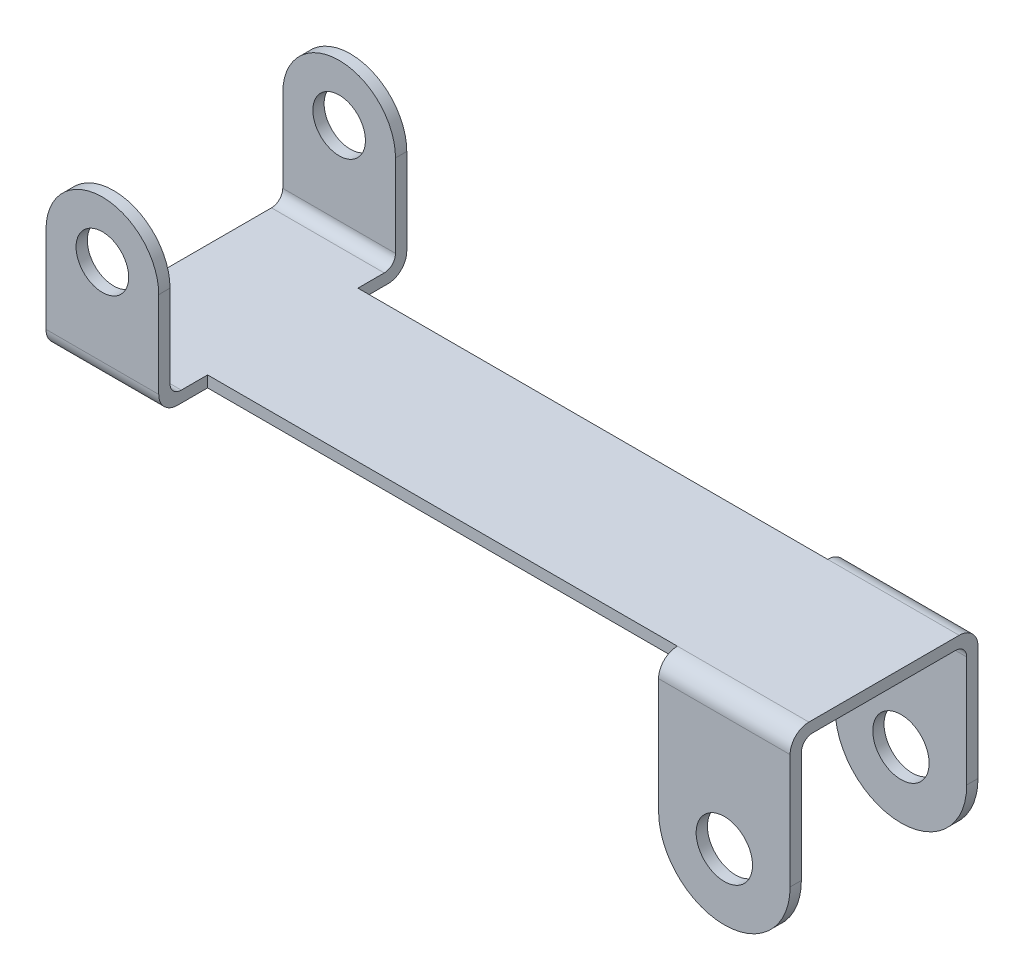
ISO-10303-21;
HEADER;
FILE_DESCRIPTION(('STEP AP214'),'2;1');
FILE_NAME('part.step','',(''),(''),'','','');
FILE_SCHEMA(('AUTOMOTIVE_DESIGN { 1 0 10303 214 1 1 1 1 }'));
ENDSEC;
DATA;
#1=APPLICATION_CONTEXT('core data for automotive mechanical design processes');
#2=APPLICATION_PROTOCOL_DEFINITION('international standard','automotive_design',2000,#1);
#3=PRODUCT_CONTEXT('',#1,'mechanical');
#4=PRODUCT('Part','Part','',(#3));
#5=PRODUCT_RELATED_PRODUCT_CATEGORY('part','',(#4));
#6=PRODUCT_DEFINITION_FORMATION('','',#4);
#7=PRODUCT_DEFINITION_CONTEXT('part definition',#1,'design');
#8=PRODUCT_DEFINITION('design','',#6,#7);
#9=PRODUCT_DEFINITION_SHAPE('','',#8);
#10=(LENGTH_UNIT() NAMED_UNIT(*) SI_UNIT(.MILLI.,.METRE.));
#11=(NAMED_UNIT(*) PLANE_ANGLE_UNIT() SI_UNIT($,.RADIAN.));
#12=(NAMED_UNIT(*) SI_UNIT($,.STERADIAN.) SOLID_ANGLE_UNIT());
#13=UNCERTAINTY_MEASURE_WITH_UNIT(LENGTH_MEASURE(1.E-05),#10,'distance_accuracy_value','');
#14=(GEOMETRIC_REPRESENTATION_CONTEXT(3) GLOBAL_UNCERTAINTY_ASSIGNED_CONTEXT((#13)) GLOBAL_UNIT_ASSIGNED_CONTEXT((#10,
#11,#12)) REPRESENTATION_CONTEXT('',''));
#15=CARTESIAN_POINT('',(0.,0.,0.));
#16=DIRECTION('',(0.,0.,1.));
#17=DIRECTION('',(1.,0.,0.));
#18=AXIS2_PLACEMENT_3D('',#15,#16,#17);
#19=CARTESIAN_POINT('',(17.25,-3.25,-0.5));
#20=DIRECTION('',(0.,0.,-1.));
#21=DIRECTION('',(-1.,0.,0.));
#22=AXIS2_PLACEMENT_3D('',#19,#20,#21);
#23=CYLINDRICAL_SURFACE('',#22,1.75);
#24=DIRECTION('',(0.,0.,1.));
#25=VECTOR('',#24,1.);
#26=CARTESIAN_POINT('',(15.5,-3.25,-0.5));
#27=LINE('',#26,#25);
#28=CARTESIAN_POINT('',(15.5,-3.25,-0.5));
#29=VERTEX_POINT('',#28);
#30=CARTESIAN_POINT('',(15.5,-3.25,-0.2));
#31=VERTEX_POINT('',#30);
#32=EDGE_CURVE('E300',#29,#31,#27,.T.);
#33=ORIENTED_EDGE('',*,*,#32,.F.);
#34=CARTESIAN_POINT('',(17.25,-3.25,-0.5));
#35=DIRECTION('',(0.,0.,-1.));
#36=DIRECTION('',(-1.,0.,0.));
#37=AXIS2_PLACEMENT_3D('',#34,#35,#36);
#38=CIRCLE('',#37,1.75);
#39=CARTESIAN_POINT('',(19.,-3.25,-0.5));
#40=VERTEX_POINT('',#39);
#41=EDGE_CURVE('E306',#40,#29,#38,.T.);
#42=ORIENTED_EDGE('',*,*,#41,.F.);
#43=DIRECTION('',(0.,0.,-1.));
#44=VECTOR('',#43,1.);
#45=CARTESIAN_POINT('',(19.,-3.25,0.));
#46=LINE('',#45,#44);
#47=CARTESIAN_POINT('',(19.,-3.25,-0.2));
#48=VERTEX_POINT('',#47);
#49=EDGE_CURVE('E303',#48,#40,#46,.T.);
#50=ORIENTED_EDGE('',*,*,#49,.F.);
#51=CARTESIAN_POINT('',(17.25,-3.25,-0.2));
#52=DIRECTION('',(0.,0.,-1.));
#53=DIRECTION('',(-1.,0.,0.));
#54=AXIS2_PLACEMENT_3D('',#51,#52,#53);
#55=CIRCLE('',#54,1.75);
#56=EDGE_CURVE('E308',#31,#48,#55,.F.);
#57=ORIENTED_EDGE('',*,*,#56,.F.);
#58=EDGE_LOOP('',(#33,#42,#50,#57));
#59=FACE_BOUND('',#58,.T.);
#60=ADVANCED_FACE('F34',(#59),#23,.T.);
#61=CARTESIAN_POINT('',(17.25,-3.25,4.2));
#62=DIRECTION('',(0.,0.,-1.));
#63=DIRECTION('',(-1.,0.,0.));
#64=AXIS2_PLACEMENT_3D('',#61,#62,#63);
#65=CYLINDRICAL_SURFACE('',#64,1.75);
#66=DIRECTION('',(0.,0.,-1.));
#67=VECTOR('',#66,1.);
#68=CARTESIAN_POINT('',(15.5,-3.25,4.));
#69=LINE('',#68,#67);
#70=CARTESIAN_POINT('',(15.5,-3.25,4.2));
#71=VERTEX_POINT('',#70);
#72=CARTESIAN_POINT('',(15.5,-3.25,4.5));
#73=VERTEX_POINT('',#72);
#74=EDGE_CURVE('E285',#71,#73,#69,.F.);
#75=ORIENTED_EDGE('',*,*,#74,.F.);
#76=CARTESIAN_POINT('',(17.25,-3.25,4.2));
#77=DIRECTION('',(0.,0.,1.));
#78=DIRECTION('',(1.,0.,0.));
#79=AXIS2_PLACEMENT_3D('',#76,#77,#78);
#80=CIRCLE('',#79,1.75);
#81=CARTESIAN_POINT('',(19.,-3.25,4.2));
#82=VERTEX_POINT('',#81);
#83=EDGE_CURVE('E296',#82,#71,#80,.F.);
#84=ORIENTED_EDGE('',*,*,#83,.F.);
#85=DIRECTION('',(0.,0.,1.));
#86=VECTOR('',#85,1.);
#87=CARTESIAN_POINT('',(19.,-3.25,4.2));
#88=LINE('',#87,#86);
#89=CARTESIAN_POINT('',(19.,-3.25,4.5));
#90=VERTEX_POINT('',#89);
#91=EDGE_CURVE('E293',#90,#82,#88,.F.);
#92=ORIENTED_EDGE('',*,*,#91,.F.);
#93=CARTESIAN_POINT('',(17.25,-3.25,4.5));
#94=DIRECTION('',(0.,0.,1.));
#95=DIRECTION('',(1.,0.,0.));
#96=AXIS2_PLACEMENT_3D('',#93,#94,#95);
#97=CIRCLE('',#96,1.75);
#98=EDGE_CURVE('E298',#73,#90,#97,.T.);
#99=ORIENTED_EDGE('',*,*,#98,.F.);
#100=EDGE_LOOP('',(#75,#84,#92,#99));
#101=FACE_BOUND('',#100,.T.);
#102=ADVANCED_FACE('F496',(#101),#65,.T.);
#103=CARTESIAN_POINT('',(0.,0.,0.));
#104=DIRECTION('',(0.,1.,0.));
#105=DIRECTION('',(0.,0.,1.));
#106=AXIS2_PLACEMENT_3D('',#103,#104,#105);
#107=PLANE('',#106);
#108=DIRECTION('',(0.,0.,1.));
#109=VECTOR('',#108,1.);
#110=CARTESIAN_POINT('',(3.,0.,4.));
#111=LINE('',#110,#109);
#112=CARTESIAN_POINT('',(3.,0.,4.));
#113=VERTEX_POINT('',#112);
#114=CARTESIAN_POINT('',(3.,0.,4.8));
#115=VERTEX_POINT('',#114);
#116=EDGE_CURVE('E233',#113,#115,#111,.T.);
#117=ORIENTED_EDGE('',*,*,#116,.T.);
#118=DIRECTION('',(-1.,0.,0.));
#119=VECTOR('',#118,1.);
#120=CARTESIAN_POINT('',(0.,0.,4.8));
#121=LINE('',#120,#119);
#122=CARTESIAN_POINT('',(0.,0.,4.8));
#123=VERTEX_POINT('',#122);
#124=EDGE_CURVE('E359',#115,#123,#121,.T.);
#125=ORIENTED_EDGE('',*,*,#124,.T.);
#126=DIRECTION('',(0.,0.,1.));
#127=VECTOR('',#126,1.);
#128=CARTESIAN_POINT('',(0.,0.,0.));
#129=LINE('',#128,#127);
#130=CARTESIAN_POINT('',(0.,0.,-0.8));
#131=VERTEX_POINT('',#130);
#132=EDGE_CURVE('E255',#131,#123,#129,.T.);
#133=ORIENTED_EDGE('',*,*,#132,.F.);
#134=DIRECTION('',(1.,0.,0.));
#135=VECTOR('',#134,1.);
#136=CARTESIAN_POINT('',(3.,0.,-0.8));
#137=LINE('',#136,#135);
#138=CARTESIAN_POINT('',(3.,0.,-0.8));
#139=VERTEX_POINT('',#138);
#140=EDGE_CURVE('E356',#131,#139,#137,.T.);
#141=ORIENTED_EDGE('',*,*,#140,.T.);
#142=DIRECTION('',(0.,0.,1.));
#143=VECTOR('',#142,1.);
#144=CARTESIAN_POINT('',(3.,0.,0.));
#145=LINE('',#144,#143);
#146=CARTESIAN_POINT('',(3.,0.,0.));
#147=VERTEX_POINT('',#146);
#148=EDGE_CURVE('E444',#139,#147,#145,.T.);
#149=ORIENTED_EDGE('',*,*,#148,.T.);
#150=DIRECTION('',(-1.,0.,0.));
#151=VECTOR('',#150,1.);
#152=CARTESIAN_POINT('',(0.,0.,0.));
#153=LINE('',#152,#151);
#154=CARTESIAN_POINT('',(15.5,0.,0.));
#155=VERTEX_POINT('',#154);
#156=EDGE_CURVE('E248',#155,#147,#153,.T.);
#157=ORIENTED_EDGE('',*,*,#156,.F.);
#158=DIRECTION('',(0.,0.,1.));
#159=VECTOR('',#158,1.);
#160=CARTESIAN_POINT('',(15.5,0.,0.));
#161=LINE('',#160,#159);
#162=CARTESIAN_POINT('',(15.5,0.,0.0999999999999998));
#163=VERTEX_POINT('',#162);
#164=EDGE_CURVE('E320',#155,#163,#161,.T.);
#165=ORIENTED_EDGE('',*,*,#164,.T.);
#166=DIRECTION('',(-1.,0.,0.));
#167=VECTOR('',#166,1.);
#168=CARTESIAN_POINT('',(19.,0.,0.0999999999999998));
#169=LINE('',#168,#167);
#170=CARTESIAN_POINT('',(19.,0.,0.0999999999999998));
#171=VERTEX_POINT('',#170);
#172=EDGE_CURVE('E318',#163,#171,#169,.F.);
#173=ORIENTED_EDGE('',*,*,#172,.T.);
#174=DIRECTION('',(0.,0.,-1.));
#175=VECTOR('',#174,1.);
#176=CARTESIAN_POINT('',(19.,0.,0.));
#177=LINE('',#176,#175);
#178=CARTESIAN_POINT('',(19.,0.,3.9));
#179=VERTEX_POINT('',#178);
#180=EDGE_CURVE('E261',#179,#171,#177,.T.);
#181=ORIENTED_EDGE('',*,*,#180,.F.);
#182=DIRECTION('',(1.,0.,0.));
#183=VECTOR('',#182,1.);
#184=CARTESIAN_POINT('',(15.5,0.,3.9));
#185=LINE('',#184,#183);
#186=CARTESIAN_POINT('',(15.5,0.,3.9));
#187=VERTEX_POINT('',#186);
#188=EDGE_CURVE('E325',#179,#187,#185,.F.);
#189=ORIENTED_EDGE('',*,*,#188,.T.);
#190=DIRECTION('',(0.,0.,1.));
#191=VECTOR('',#190,1.);
#192=CARTESIAN_POINT('',(15.5,0.,0.));
#193=LINE('',#192,#191);
#194=CARTESIAN_POINT('',(15.5,0.,4.));
#195=VERTEX_POINT('',#194);
#196=EDGE_CURVE('E323',#187,#195,#193,.T.);
#197=ORIENTED_EDGE('',*,*,#196,.T.);
#198=DIRECTION('',(1.,0.,0.));
#199=VECTOR('',#198,1.);
#200=CARTESIAN_POINT('',(0.,0.,4.));
#201=LINE('',#200,#199);
#202=EDGE_CURVE('E258',#113,#195,#201,.T.);
#203=ORIENTED_EDGE('',*,*,#202,.F.);
#204=EDGE_LOOP('',(#117,#125,#133,#141,#149,#157,#165,#173,#181,#189,#197,#203));
#205=FACE_BOUND('',#204,.T.);
#206=ADVANCED_FACE('F467',(#205),#107,.F.);
#207=CARTESIAN_POINT('',(1.5,2.8,5.));
#208=DIRECTION('',(0.,0.,-1.));
#209=DIRECTION('',(-1.,0.,0.));
#210=AXIS2_PLACEMENT_3D('',#207,#208,#209);
#211=CYLINDRICAL_SURFACE('',#210,1.5);
#212=DIRECTION('',(0.,0.,-1.));
#213=VECTOR('',#212,1.);
#214=CARTESIAN_POINT('',(3.,2.8,4.));
#215=LINE('',#214,#213);
#216=CARTESIAN_POINT('',(3.,2.8,5.));
#217=VERTEX_POINT('',#216);
#218=CARTESIAN_POINT('',(3.,2.8,5.3));
#219=VERTEX_POINT('',#218);
#220=EDGE_CURVE('E275',#217,#219,#215,.F.);
#221=ORIENTED_EDGE('',*,*,#220,.F.);
#222=CARTESIAN_POINT('',(1.5,2.8,5.));
#223=DIRECTION('',(0.,0.,1.));
#224=DIRECTION('',(1.,0.,0.));
#225=AXIS2_PLACEMENT_3D('',#222,#223,#224);
#226=CIRCLE('',#225,1.5);
#227=CARTESIAN_POINT('',(0.,2.8,5.));
#228=VERTEX_POINT('',#227);
#229=EDGE_CURVE('E281',#228,#217,#226,.F.);
#230=ORIENTED_EDGE('',*,*,#229,.F.);
#231=DIRECTION('',(0.,0.,1.));
#232=VECTOR('',#231,1.);
#233=CARTESIAN_POINT('',(0.,2.8,5.));
#234=LINE('',#233,#232);
#235=CARTESIAN_POINT('',(0.,2.8,5.3));
#236=VERTEX_POINT('',#235);
#237=EDGE_CURVE('E278',#236,#228,#234,.F.);
#238=ORIENTED_EDGE('',*,*,#237,.F.);
#239=CARTESIAN_POINT('',(1.5,2.8,5.3));
#240=DIRECTION('',(0.,0.,1.));
#241=DIRECTION('',(1.,0.,0.));
#242=AXIS2_PLACEMENT_3D('',#239,#240,#241);
#243=CIRCLE('',#242,1.5);
#244=EDGE_CURVE('E283',#219,#236,#243,.T.);
#245=ORIENTED_EDGE('',*,*,#244,.F.);
#246=EDGE_LOOP('',(#221,#230,#238,#245));
#247=FACE_BOUND('',#246,.T.);
#248=ADVANCED_FACE('F687',(#247),#211,.T.);
#249=CARTESIAN_POINT('',(1.5,2.8,-1.3));
#250=DIRECTION('',(0.,0.,-1.));
#251=DIRECTION('',(-1.,0.,0.));
#252=AXIS2_PLACEMENT_3D('',#249,#250,#251);
#253=CYLINDRICAL_SURFACE('',#252,1.5);
#254=DIRECTION('',(0.,0.,-1.));
#255=VECTOR('',#254,1.);
#256=CARTESIAN_POINT('',(3.,2.8,0.));
#257=LINE('',#256,#255);
#258=CARTESIAN_POINT('',(3.,2.8,-1.3));
#259=VERTEX_POINT('',#258);
#260=CARTESIAN_POINT('',(3.,2.8,-1.));
#261=VERTEX_POINT('',#260);
#262=EDGE_CURVE('E254',#259,#261,#257,.F.);
#263=ORIENTED_EDGE('',*,*,#262,.F.);
#264=CARTESIAN_POINT('',(1.5,2.8,-1.3));
#265=DIRECTION('',(0.,0.,-1.));
#266=DIRECTION('',(-1.,0.,0.));
#267=AXIS2_PLACEMENT_3D('',#264,#265,#266);
#268=CIRCLE('',#267,1.5);
#269=CARTESIAN_POINT('',(0.,2.8,-1.3));
#270=VERTEX_POINT('',#269);
#271=EDGE_CURVE('E271',#270,#259,#268,.T.);
#272=ORIENTED_EDGE('',*,*,#271,.F.);
#273=DIRECTION('',(0.,0.,1.));
#274=VECTOR('',#273,1.);
#275=CARTESIAN_POINT('',(0.,2.8,-1.3));
#276=LINE('',#275,#274);
#277=CARTESIAN_POINT('',(0.,2.8,-1.));
#278=VERTEX_POINT('',#277);
#279=EDGE_CURVE('E268',#278,#270,#276,.F.);
#280=ORIENTED_EDGE('',*,*,#279,.F.);
#281=CARTESIAN_POINT('',(1.5,2.8,-1.));
#282=DIRECTION('',(0.,0.,-1.));
#283=DIRECTION('',(-1.,0.,0.));
#284=AXIS2_PLACEMENT_3D('',#281,#282,#283);
#285=CIRCLE('',#284,1.5);
#286=EDGE_CURVE('E273',#261,#278,#285,.F.);
#287=ORIENTED_EDGE('',*,*,#286,.F.);
#288=EDGE_LOOP('',(#263,#272,#280,#287));
#289=FACE_BOUND('',#288,.T.);
#290=ADVANCED_FACE('F482',(#289),#253,.T.);
#291=CARTESIAN_POINT('',(0.,0.3,0.));
#292=DIRECTION('',(0.,1.,0.));
#293=DIRECTION('',(0.,0.,1.));
#294=AXIS2_PLACEMENT_3D('',#291,#292,#293);
#295=PLANE('',#294);
#296=DIRECTION('',(1.,0.,0.));
#297=VECTOR('',#296,1.);
#298=CARTESIAN_POINT('',(0.,0.3,4.));
#299=LINE('',#298,#297);
#300=CARTESIAN_POINT('',(3.,0.3,4.));
#301=VERTEX_POINT('',#300);
#302=CARTESIAN_POINT('',(15.5,0.3,4.));
#303=VERTEX_POINT('',#302);
#304=EDGE_CURVE('E219',#301,#303,#299,.T.);
#305=ORIENTED_EDGE('',*,*,#304,.T.);
#306=DIRECTION('',(1.,0.,0.));
#307=VECTOR('',#306,1.);
#308=CARTESIAN_POINT('',(0.,0.3,4.00000000000001));
#309=LINE('',#308,#307);
#310=CARTESIAN_POINT('',(19.,0.3,4.));
#311=VERTEX_POINT('',#310);
#312=EDGE_CURVE('E377',#303,#311,#309,.T.);
#313=ORIENTED_EDGE('',*,*,#312,.T.);
#314=DIRECTION('',(0.,0.,-1.));
#315=VECTOR('',#314,1.);
#316=CARTESIAN_POINT('',(19.,0.3,0.));
#317=LINE('',#316,#315);
#318=CARTESIAN_POINT('',(19.,0.3,0.));
#319=VERTEX_POINT('',#318);
#320=EDGE_CURVE('E242',#311,#319,#317,.T.);
#321=ORIENTED_EDGE('',*,*,#320,.T.);
#322=DIRECTION('',(-1.,0.,0.));
#323=VECTOR('',#322,1.);
#324=CARTESIAN_POINT('',(0.,0.3,0.));
#325=LINE('',#324,#323);
#326=CARTESIAN_POINT('',(15.5,0.3,0.));
#327=VERTEX_POINT('',#326);
#328=EDGE_CURVE('E374',#319,#327,#325,.T.);
#329=ORIENTED_EDGE('',*,*,#328,.T.);
#330=DIRECTION('',(-1.,0.,0.));
#331=VECTOR('',#330,1.);
#332=CARTESIAN_POINT('',(0.,0.3,0.));
#333=LINE('',#332,#331);
#334=CARTESIAN_POINT('',(3.,0.3,0.));
#335=VERTEX_POINT('',#334);
#336=EDGE_CURVE('E246',#327,#335,#333,.T.);
#337=ORIENTED_EDGE('',*,*,#336,.T.);
#338=DIRECTION('',(0.,0.,1.));
#339=VECTOR('',#338,1.);
#340=CARTESIAN_POINT('',(3.,0.3,0.));
#341=LINE('',#340,#339);
#342=CARTESIAN_POINT('',(3.,0.3,-0.7));
#343=VERTEX_POINT('',#342);
#344=EDGE_CURVE('E448',#343,#335,#341,.T.);
#345=ORIENTED_EDGE('',*,*,#344,.F.);
#346=DIRECTION('',(1.,0.,0.));
#347=VECTOR('',#346,1.);
#348=CARTESIAN_POINT('',(0.,0.3,-0.7));
#349=LINE('',#348,#347);
#350=CARTESIAN_POINT('',(0.,0.3,-0.7));
#351=VERTEX_POINT('',#350);
#352=EDGE_CURVE('E335',#343,#351,#349,.F.);
#353=ORIENTED_EDGE('',*,*,#352,.T.);
#354=DIRECTION('',(0.,0.,1.));
#355=VECTOR('',#354,1.);
#356=CARTESIAN_POINT('',(0.,0.3,0.));
#357=LINE('',#356,#355);
#358=CARTESIAN_POINT('',(0.,0.3,4.7));
#359=VERTEX_POINT('',#358);
#360=EDGE_CURVE('E243',#351,#359,#357,.T.);
#361=ORIENTED_EDGE('',*,*,#360,.T.);
#362=DIRECTION('',(-1.,0.,0.));
#363=VECTOR('',#362,1.);
#364=CARTESIAN_POINT('',(0.,0.3,4.7));
#365=LINE('',#364,#363);
#366=CARTESIAN_POINT('',(3.,0.3,4.7));
#367=VERTEX_POINT('',#366);
#368=EDGE_CURVE('E223',#359,#367,#365,.F.);
#369=ORIENTED_EDGE('',*,*,#368,.T.);
#370=DIRECTION('',(0.,0.,1.));
#371=VECTOR('',#370,1.);
#372=CARTESIAN_POINT('',(3.,0.3,4.));
#373=LINE('',#372,#371);
#374=EDGE_CURVE('E214',#301,#367,#373,.T.);
#375=ORIENTED_EDGE('',*,*,#374,.F.);
#376=EDGE_LOOP('',(#305,#313,#321,#329,#337,#345,#353,#361,#369,#375));
#377=FACE_BOUND('',#376,.T.);
#378=ADVANCED_FACE('F216',(#377),#295,.T.);
#379=CARTESIAN_POINT('',(0.,0.3,0.));
#380=DIRECTION('',(0.,0.,1.));
#381=DIRECTION('',(1.,0.,0.));
#382=AXIS2_PLACEMENT_3D('',#379,#380,#381);
#383=PLANE('',#382);
#384=ORIENTED_EDGE('',*,*,#336,.F.);
#385=DIRECTION('',(0.,1.,0.));
#386=VECTOR('',#385,1.);
#387=CARTESIAN_POINT('',(15.5,-3.53553390593274,0.));
#388=LINE('',#387,#386);
#389=EDGE_CURVE('E408',#155,#327,#388,.T.);
#390=ORIENTED_EDGE('',*,*,#389,.F.);
#391=ORIENTED_EDGE('',*,*,#156,.T.);
#392=DIRECTION('',(0.,-1.,0.));
#393=VECTOR('',#392,1.);
#394=CARTESIAN_POINT('',(3.,3.56955654485436,0.));
#395=LINE('',#394,#393);
#396=EDGE_CURVE('E410',#335,#147,#395,.T.);
#397=ORIENTED_EDGE('',*,*,#396,.F.);
#398=EDGE_LOOP('',(#384,#390,#391,#397));
#399=FACE_BOUND('',#398,.T.);
#400=ADVANCED_FACE('F407',(#399),#383,.F.);
#401=CARTESIAN_POINT('',(0.,0.3,0.));
#402=DIRECTION('',(1.,0.,0.));
#403=DIRECTION('',(0.,0.,-1.));
#404=AXIS2_PLACEMENT_3D('',#401,#402,#403);
#405=PLANE('',#404);
#406=ORIENTED_EDGE('',*,*,#132,.T.);
#407=CARTESIAN_POINT('',(0.,0.5,4.8));
#408=DIRECTION('',(1.,0.,0.));
#409=DIRECTION('',(0.,0.,-1.));
#410=AXIS2_PLACEMENT_3D('',#407,#408,#409);
#411=CIRCLE('',#410,0.5);
#412=CARTESIAN_POINT('',(0.,0.5,5.3));
#413=VERTEX_POINT('',#412);
#414=EDGE_CURVE('E364',#123,#413,#411,.F.);
#415=ORIENTED_EDGE('',*,*,#414,.T.);
#416=DIRECTION('',(0.,-1.,0.));
#417=VECTOR('',#416,1.);
#418=CARTESIAN_POINT('',(0.,3.56955654485436,5.3));
#419=LINE('',#418,#417);
#420=EDGE_CURVE('E441',#236,#413,#419,.T.);
#421=ORIENTED_EDGE('',*,*,#420,.F.);
#422=ORIENTED_EDGE('',*,*,#237,.T.);
#423=DIRECTION('',(0.,-1.,0.));
#424=VECTOR('',#423,1.);
#425=CARTESIAN_POINT('',(0.,4.3,5.));
#426=LINE('',#425,#424);
#427=CARTESIAN_POINT('',(0.,0.6,5.));
#428=VERTEX_POINT('',#427);
#429=EDGE_CURVE('E428',#228,#428,#426,.T.);
#430=ORIENTED_EDGE('',*,*,#429,.T.);
#431=CARTESIAN_POINT('',(0.,0.6,4.7));
#432=DIRECTION('',(1.,0.,0.));
#433=DIRECTION('',(0.,0.,-1.));
#434=AXIS2_PLACEMENT_3D('',#431,#432,#433);
#435=CIRCLE('',#434,0.3);
#436=EDGE_CURVE('E352',#428,#359,#435,.T.);
#437=ORIENTED_EDGE('',*,*,#436,.T.);
#438=ORIENTED_EDGE('',*,*,#360,.F.);
#439=CARTESIAN_POINT('',(0.,0.6,-0.7));
#440=DIRECTION('',(1.,0.,0.));
#441=DIRECTION('',(0.,0.,-1.));
#442=AXIS2_PLACEMENT_3D('',#439,#440,#441);
#443=CIRCLE('',#442,0.3);
#444=CARTESIAN_POINT('',(0.,0.6,-1.));
#445=VERTEX_POINT('',#444);
#446=EDGE_CURVE('E350',#351,#445,#443,.T.);
#447=ORIENTED_EDGE('',*,*,#446,.T.);
#448=DIRECTION('',(0.,-1.,0.));
#449=VECTOR('',#448,1.);
#450=CARTESIAN_POINT('',(0.,4.3,-1.));
#451=LINE('',#450,#449);
#452=EDGE_CURVE('E437',#278,#445,#451,.T.);
#453=ORIENTED_EDGE('',*,*,#452,.F.);
#454=ORIENTED_EDGE('',*,*,#279,.T.);
#455=DIRECTION('',(0.,-1.,0.));
#456=VECTOR('',#455,1.);
#457=CARTESIAN_POINT('',(0.,3.56955654485436,-1.3));
#458=LINE('',#457,#456);
#459=CARTESIAN_POINT('',(0.,0.5,-1.3));
#460=VERTEX_POINT('',#459);
#461=EDGE_CURVE('E259',#270,#460,#458,.T.);
#462=ORIENTED_EDGE('',*,*,#461,.T.);
#463=CARTESIAN_POINT('',(0.,0.5,-0.8));
#464=DIRECTION('',(1.,0.,0.));
#465=DIRECTION('',(0.,0.,-1.));
#466=AXIS2_PLACEMENT_3D('',#463,#464,#465);
#467=CIRCLE('',#466,0.5);
#468=EDGE_CURVE('E362',#460,#131,#467,.F.);
#469=ORIENTED_EDGE('',*,*,#468,.T.);
#470=EDGE_LOOP('',(#406,#415,#421,#422,#430,#437,#438,#447,#453,#454,#462,#469));
#471=FACE_BOUND('',#470,.T.);
#472=ADVANCED_FACE('F456',(#471),#405,.F.);
#473=CARTESIAN_POINT('',(0.,0.3,4.));
#474=DIRECTION('',(0.,0.,-1.));
#475=DIRECTION('',(-1.,0.,0.));
#476=AXIS2_PLACEMENT_3D('',#473,#474,#475);
#477=PLANE('',#476);
#478=ORIENTED_EDGE('',*,*,#202,.T.);
#479=DIRECTION('',(0.,1.,0.));
#480=VECTOR('',#479,1.);
#481=CARTESIAN_POINT('',(15.5,-3.53553390593274,4.));
#482=LINE('',#481,#480);
#483=EDGE_CURVE('E241',#195,#303,#482,.T.);
#484=ORIENTED_EDGE('',*,*,#483,.T.);
#485=ORIENTED_EDGE('',*,*,#304,.F.);
#486=DIRECTION('',(0.,-1.,0.));
#487=VECTOR('',#486,1.);
#488=CARTESIAN_POINT('',(3.,3.56955654485436,4.));
#489=LINE('',#488,#487);
#490=EDGE_CURVE('E227',#301,#113,#489,.T.);
#491=ORIENTED_EDGE('',*,*,#490,.T.);
#492=EDGE_LOOP('',(#478,#484,#485,#491));
#493=FACE_BOUND('',#492,.T.);
#494=ADVANCED_FACE('F239',(#493),#477,.F.);
#495=CARTESIAN_POINT('',(19.,0.3,0.));
#496=DIRECTION('',(-1.,0.,0.));
#497=DIRECTION('',(0.,0.,1.));
#498=AXIS2_PLACEMENT_3D('',#495,#496,#497);
#499=PLANE('',#498);
#500=ORIENTED_EDGE('',*,*,#320,.F.);
#501=CARTESIAN_POINT('',(19.,-0.2,4.));
#502=DIRECTION('',(-1.,0.,0.));
#503=DIRECTION('',(0.,0.,1.));
#504=AXIS2_PLACEMENT_3D('',#501,#502,#503);
#505=CIRCLE('',#504,0.5);
#506=CARTESIAN_POINT('',(19.,-0.2,4.5));
#507=VERTEX_POINT('',#506);
#508=EDGE_CURVE('E381',#311,#507,#505,.F.);
#509=ORIENTED_EDGE('',*,*,#508,.T.);
#510=DIRECTION('',(0.,1.,0.));
#511=VECTOR('',#510,1.);
#512=CARTESIAN_POINT('',(19.,-3.53553390593274,4.5));
#513=LINE('',#512,#511);
#514=EDGE_CURVE('E423',#90,#507,#513,.T.);
#515=ORIENTED_EDGE('',*,*,#514,.F.);
#516=ORIENTED_EDGE('',*,*,#91,.T.);
#517=DIRECTION('',(0.,1.,0.));
#518=VECTOR('',#517,1.);
#519=CARTESIAN_POINT('',(19.,-5.,4.2));
#520=LINE('',#519,#518);
#521=CARTESIAN_POINT('',(19.,-0.3,4.2));
#522=VERTEX_POINT('',#521);
#523=EDGE_CURVE('E841',#82,#522,#520,.T.);
#524=ORIENTED_EDGE('',*,*,#523,.T.);
#525=CARTESIAN_POINT('',(19.,-0.3,3.9));
#526=DIRECTION('',(-1.,0.,0.));
#527=DIRECTION('',(0.,0.,1.));
#528=AXIS2_PLACEMENT_3D('',#525,#526,#527);
#529=CIRCLE('',#528,0.3);
#530=EDGE_CURVE('E340',#522,#179,#529,.T.);
#531=ORIENTED_EDGE('',*,*,#530,.T.);
#532=ORIENTED_EDGE('',*,*,#180,.T.);
#533=CARTESIAN_POINT('',(19.,-0.3,0.0999999999999998));
#534=DIRECTION('',(-1.,0.,0.));
#535=DIRECTION('',(0.,0.,1.));
#536=AXIS2_PLACEMENT_3D('',#533,#534,#535);
#537=CIRCLE('',#536,0.3);
#538=CARTESIAN_POINT('',(19.,-0.3,-0.2));
#539=VERTEX_POINT('',#538);
#540=EDGE_CURVE('E346',#171,#539,#537,.T.);
#541=ORIENTED_EDGE('',*,*,#540,.T.);
#542=DIRECTION('',(0.,1.,0.));
#543=VECTOR('',#542,1.);
#544=CARTESIAN_POINT('',(19.,-5.,-0.2));
#545=LINE('',#544,#543);
#546=EDGE_CURVE('E848',#48,#539,#545,.T.);
#547=ORIENTED_EDGE('',*,*,#546,.F.);
#548=ORIENTED_EDGE('',*,*,#49,.T.);
#549=DIRECTION('',(0.,1.,0.));
#550=VECTOR('',#549,1.);
#551=CARTESIAN_POINT('',(19.,-3.53553390593274,-0.5));
#552=LINE('',#551,#550);
#553=CARTESIAN_POINT('',(19.,-0.2,-0.5));
#554=VERTEX_POINT('',#553);
#555=EDGE_CURVE('E399',#40,#554,#552,.T.);
#556=ORIENTED_EDGE('',*,*,#555,.T.);
#557=CARTESIAN_POINT('',(19.,-0.2,0.));
#558=DIRECTION('',(-1.,0.,0.));
#559=DIRECTION('',(0.,0.,1.));
#560=AXIS2_PLACEMENT_3D('',#557,#558,#559);
#561=CIRCLE('',#560,0.5);
#562=EDGE_CURVE('E379',#554,#319,#561,.F.);
#563=ORIENTED_EDGE('',*,*,#562,.T.);
#564=EDGE_LOOP('',(#500,#509,#515,#516,#524,#531,#532,#541,#547,#548,#556,#563));
#565=FACE_BOUND('',#564,.T.);
#566=ADVANCED_FACE('F394',(#565),#499,.F.);
#567=CARTESIAN_POINT('',(0.,3.56955654485436,-1.3));
#568=DIRECTION('',(0.,0.,-1.));
#569=DIRECTION('',(-1.,0.,0.));
#570=AXIS2_PLACEMENT_3D('',#567,#568,#569);
#571=PLANE('',#570);
#572=CARTESIAN_POINT('',(1.5,2.79999999999999,-1.3));
#573=DIRECTION('',(0.,0.,-1.));
#574=DIRECTION('',(-1.,0.,0.));
#575=AXIS2_PLACEMENT_3D('',#572,#573,#574);
#576=CIRCLE('',#575,0.7);
#577=CARTESIAN_POINT('',(0.8,2.79999999999999,-1.3));
#578=VERTEX_POINT('',#577);
#579=EDGE_CURVE('E413',#578,#578,#576,.T.);
#580=ORIENTED_EDGE('',*,*,#579,.F.);
#581=EDGE_LOOP('',(#580));
#582=FACE_BOUND('',#581,.T.);
#583=DIRECTION('',(0.,-1.,0.));
#584=VECTOR('',#583,1.);
#585=CARTESIAN_POINT('',(3.,3.56955654485436,-1.3));
#586=LINE('',#585,#584);
#587=CARTESIAN_POINT('',(3.,0.5,-1.3));
#588=VERTEX_POINT('',#587);
#589=EDGE_CURVE('E447',#259,#588,#586,.T.);
#590=ORIENTED_EDGE('',*,*,#589,.T.);
#591=DIRECTION('',(1.,0.,0.));
#592=VECTOR('',#591,1.);
#593=CARTESIAN_POINT('',(0.,0.5,-1.3));
#594=LINE('',#593,#592);
#595=EDGE_CURVE('E372',#588,#460,#594,.F.);
#596=ORIENTED_EDGE('',*,*,#595,.T.);
#597=ORIENTED_EDGE('',*,*,#461,.F.);
#598=ORIENTED_EDGE('',*,*,#271,.T.);
#599=EDGE_LOOP('',(#590,#596,#597,#598));
#600=FACE_BOUND('',#599,.T.);
#601=ADVANCED_FACE('F483',(#582,#600),#571,.T.);
#602=CARTESIAN_POINT('',(3.,3.56955654485436,0.));
#603=DIRECTION('',(1.,0.,0.));
#604=DIRECTION('',(0.,0.,-1.));
#605=AXIS2_PLACEMENT_3D('',#602,#603,#604);
#606=PLANE('',#605);
#607=ORIENTED_EDGE('',*,*,#148,.F.);
#608=CARTESIAN_POINT('',(3.,0.5,-0.8));
#609=DIRECTION('',(1.,0.,0.));
#610=DIRECTION('',(0.,0.,-1.));
#611=AXIS2_PLACEMENT_3D('',#608,#609,#610);
#612=CIRCLE('',#611,0.5);
#613=EDGE_CURVE('E370',#139,#588,#612,.T.);
#614=ORIENTED_EDGE('',*,*,#613,.T.);
#615=ORIENTED_EDGE('',*,*,#589,.F.);
#616=ORIENTED_EDGE('',*,*,#262,.T.);
#617=DIRECTION('',(0.,-1.,0.));
#618=VECTOR('',#617,1.);
#619=CARTESIAN_POINT('',(3.,4.3,-1.));
#620=LINE('',#619,#618);
#621=CARTESIAN_POINT('',(3.,0.6,-1.));
#622=VERTEX_POINT('',#621);
#623=EDGE_CURVE('E434',#261,#622,#620,.T.);
#624=ORIENTED_EDGE('',*,*,#623,.T.);
#625=CARTESIAN_POINT('',(3.,0.6,-0.7));
#626=DIRECTION('',(1.,0.,0.));
#627=DIRECTION('',(0.,0.,-1.));
#628=AXIS2_PLACEMENT_3D('',#625,#626,#627);
#629=CIRCLE('',#628,0.3);
#630=EDGE_CURVE('E348',#622,#343,#629,.F.);
#631=ORIENTED_EDGE('',*,*,#630,.T.);
#632=ORIENTED_EDGE('',*,*,#344,.T.);
#633=ORIENTED_EDGE('',*,*,#396,.T.);
#634=EDGE_LOOP('',(#607,#614,#615,#616,#624,#631,#632,#633));
#635=FACE_BOUND('',#634,.T.);
#636=ADVANCED_FACE('F469',(#635),#606,.T.);
#637=CARTESIAN_POINT('',(3.,3.56955654485436,4.));
#638=DIRECTION('',(1.,0.,0.));
#639=DIRECTION('',(0.,0.,-1.));
#640=AXIS2_PLACEMENT_3D('',#637,#638,#639);
#641=PLANE('',#640);
#642=DIRECTION('',(0.,-1.,0.));
#643=VECTOR('',#642,1.);
#644=CARTESIAN_POINT('',(3.,3.56955654485436,5.3));
#645=LINE('',#644,#643);
#646=CARTESIAN_POINT('',(3.,0.5,5.3));
#647=VERTEX_POINT('',#646);
#648=EDGE_CURVE('E226',#219,#647,#645,.T.);
#649=ORIENTED_EDGE('',*,*,#648,.T.);
#650=CARTESIAN_POINT('',(3.,0.5,4.8));
#651=DIRECTION('',(1.,0.,0.));
#652=DIRECTION('',(0.,0.,-1.));
#653=AXIS2_PLACEMENT_3D('',#650,#651,#652);
#654=CIRCLE('',#653,0.5);
#655=EDGE_CURVE('E368',#647,#115,#654,.T.);
#656=ORIENTED_EDGE('',*,*,#655,.T.);
#657=ORIENTED_EDGE('',*,*,#116,.F.);
#658=ORIENTED_EDGE('',*,*,#490,.F.);
#659=ORIENTED_EDGE('',*,*,#374,.T.);
#660=CARTESIAN_POINT('',(3.,0.6,4.7));
#661=DIRECTION('',(1.,0.,0.));
#662=DIRECTION('',(0.,0.,-1.));
#663=AXIS2_PLACEMENT_3D('',#660,#661,#662);
#664=CIRCLE('',#663,0.3);
#665=CARTESIAN_POINT('',(3.,0.6,5.));
#666=VERTEX_POINT('',#665);
#667=EDGE_CURVE('E354',#367,#666,#664,.F.);
#668=ORIENTED_EDGE('',*,*,#667,.T.);
#669=DIRECTION('',(0.,-1.,0.));
#670=VECTOR('',#669,1.);
#671=CARTESIAN_POINT('',(3.,4.3,5.));
#672=LINE('',#671,#670);
#673=EDGE_CURVE('E431',#217,#666,#672,.T.);
#674=ORIENTED_EDGE('',*,*,#673,.F.);
#675=ORIENTED_EDGE('',*,*,#220,.T.);
#676=EDGE_LOOP('',(#649,#656,#657,#658,#659,#668,#674,#675));
#677=FACE_BOUND('',#676,.T.);
#678=ADVANCED_FACE('F231',(#677),#641,.T.);
#679=CARTESIAN_POINT('',(0.,3.56955654485436,5.3));
#680=DIRECTION('',(0.,0.,1.));
#681=DIRECTION('',(1.,0.,0.));
#682=AXIS2_PLACEMENT_3D('',#679,#680,#681);
#683=PLANE('',#682);
#684=CARTESIAN_POINT('',(1.5,2.79999999999999,5.3));
#685=DIRECTION('',(0.,0.,-1.));
#686=DIRECTION('',(-1.,0.,0.));
#687=AXIS2_PLACEMENT_3D('',#684,#685,#686);
#688=CIRCLE('',#687,0.7);
#689=CARTESIAN_POINT('',(0.8,2.79999999999999,5.3));
#690=VERTEX_POINT('',#689);
#691=EDGE_CURVE('E290',#690,#690,#688,.T.);
#692=ORIENTED_EDGE('',*,*,#691,.T.);
#693=EDGE_LOOP('',(#692));
#694=FACE_BOUND('',#693,.T.);
#695=ORIENTED_EDGE('',*,*,#420,.T.);
#696=DIRECTION('',(-1.,0.,0.));
#697=VECTOR('',#696,1.);
#698=CARTESIAN_POINT('',(3.,0.5,5.3));
#699=LINE('',#698,#697);
#700=EDGE_CURVE('E366',#413,#647,#699,.F.);
#701=ORIENTED_EDGE('',*,*,#700,.T.);
#702=ORIENTED_EDGE('',*,*,#648,.F.);
#703=ORIENTED_EDGE('',*,*,#244,.T.);
#704=EDGE_LOOP('',(#695,#701,#702,#703));
#705=FACE_BOUND('',#704,.T.);
#706=ADVANCED_FACE('F605',(#694,#705),#683,.T.);
#707=CARTESIAN_POINT('',(0.,4.3,-1.));
#708=DIRECTION('',(0.,0.,-1.));
#709=DIRECTION('',(-1.,0.,0.));
#710=AXIS2_PLACEMENT_3D('',#707,#708,#709);
#711=PLANE('',#710);
#712=CARTESIAN_POINT('',(1.5,2.79999999999999,-1.));
#713=DIRECTION('',(0.,0.,-1.));
#714=DIRECTION('',(-1.,0.,0.));
#715=AXIS2_PLACEMENT_3D('',#712,#713,#714);
#716=CIRCLE('',#715,0.7);
#717=CARTESIAN_POINT('',(0.8,2.79999999999999,-1.));
#718=VERTEX_POINT('',#717);
#719=EDGE_CURVE('E289',#718,#718,#716,.T.);
#720=ORIENTED_EDGE('',*,*,#719,.T.);
#721=EDGE_LOOP('',(#720));
#722=FACE_BOUND('',#721,.T.);
#723=ORIENTED_EDGE('',*,*,#452,.T.);
#724=DIRECTION('',(1.,0.,0.));
#725=VECTOR('',#724,1.);
#726=CARTESIAN_POINT('',(0.,0.6,-1.));
#727=LINE('',#726,#725);
#728=EDGE_CURVE('E331',#445,#622,#727,.T.);
#729=ORIENTED_EDGE('',*,*,#728,.T.);
#730=ORIENTED_EDGE('',*,*,#623,.F.);
#731=ORIENTED_EDGE('',*,*,#286,.T.);
#732=EDGE_LOOP('',(#723,#729,#730,#731));
#733=FACE_BOUND('',#732,.T.);
#734=ADVANCED_FACE('F478',(#722,#733),#711,.F.);
#735=CARTESIAN_POINT('',(3.,4.3,5.));
#736=DIRECTION('',(0.,0.,1.));
#737=DIRECTION('',(1.,0.,0.));
#738=AXIS2_PLACEMENT_3D('',#735,#736,#737);
#739=PLANE('',#738);
#740=CARTESIAN_POINT('',(1.5,2.79999999999999,5.));
#741=DIRECTION('',(0.,0.,1.));
#742=DIRECTION('',(1.,0.,0.));
#743=AXIS2_PLACEMENT_3D('',#740,#741,#742);
#744=CIRCLE('',#743,0.7);
#745=CARTESIAN_POINT('',(2.2,2.79999999999999,5.));
#746=VERTEX_POINT('',#745);
#747=EDGE_CURVE('E286',#746,#746,#744,.T.);
#748=ORIENTED_EDGE('',*,*,#747,.T.);
#749=EDGE_LOOP('',(#748));
#750=FACE_BOUND('',#749,.T.);
#751=ORIENTED_EDGE('',*,*,#673,.T.);
#752=DIRECTION('',(-1.,0.,0.));
#753=VECTOR('',#752,1.);
#754=CARTESIAN_POINT('',(3.,0.6,5.));
#755=LINE('',#754,#753);
#756=EDGE_CURVE('E337',#666,#428,#755,.T.);
#757=ORIENTED_EDGE('',*,*,#756,.T.);
#758=ORIENTED_EDGE('',*,*,#429,.F.);
#759=ORIENTED_EDGE('',*,*,#229,.T.);
#760=EDGE_LOOP('',(#751,#757,#758,#759));
#761=FACE_BOUND('',#760,.T.);
#762=ADVANCED_FACE('F739',(#750,#761),#739,.F.);
#763=CARTESIAN_POINT('',(1.5,2.79999999999999,5.3));
#764=DIRECTION('',(0.,0.,-1.));
#765=DIRECTION('',(-1.,0.,0.));
#766=AXIS2_PLACEMENT_3D('',#763,#764,#765);
#767=CYLINDRICAL_SURFACE('',#766,0.7);
#768=ORIENTED_EDGE('',*,*,#691,.F.);
#769=EDGE_LOOP('',(#768));
#770=FACE_BOUND('',#769,.T.);
#771=ORIENTED_EDGE('',*,*,#747,.F.);
#772=EDGE_LOOP('',(#771));
#773=FACE_BOUND('',#772,.T.);
#774=ADVANCED_FACE('F744',(#770,#773),#767,.F.);
#775=ORIENTED_EDGE('',*,*,#579,.T.);
#776=EDGE_LOOP('',(#775));
#777=FACE_BOUND('',#776,.T.);
#778=ORIENTED_EDGE('',*,*,#719,.F.);
#779=EDGE_LOOP('',(#778));
#780=FACE_BOUND('',#779,.T.);
#781=ADVANCED_FACE('F597',(#777,#780),#767,.F.);
#782=CARTESIAN_POINT('',(15.5,-3.53553390593274,0.));
#783=DIRECTION('',(-1.,0.,0.));
#784=DIRECTION('',(0.,0.,1.));
#785=AXIS2_PLACEMENT_3D('',#782,#783,#784);
#786=PLANE('',#785);
#787=ORIENTED_EDGE('',*,*,#389,.T.);
#788=CARTESIAN_POINT('',(15.5,-0.2,0.));
#789=DIRECTION('',(-1.,0.,0.));
#790=DIRECTION('',(0.,0.,1.));
#791=AXIS2_PLACEMENT_3D('',#788,#789,#790);
#792=CIRCLE('',#791,0.5);
#793=CARTESIAN_POINT('',(15.5,-0.2,-0.5));
#794=VERTEX_POINT('',#793);
#795=EDGE_CURVE('E42',#327,#794,#792,.T.);
#796=ORIENTED_EDGE('',*,*,#795,.T.);
#797=DIRECTION('',(0.,1.,0.));
#798=VECTOR('',#797,1.);
#799=CARTESIAN_POINT('',(15.5,-3.53553390593274,-0.5));
#800=LINE('',#799,#798);
#801=EDGE_CURVE('E414',#29,#794,#800,.T.);
#802=ORIENTED_EDGE('',*,*,#801,.F.);
#803=ORIENTED_EDGE('',*,*,#32,.T.);
#804=DIRECTION('',(0.,1.,0.));
#805=VECTOR('',#804,1.);
#806=CARTESIAN_POINT('',(15.5,-5.,-0.2));
#807=LINE('',#806,#805);
#808=CARTESIAN_POINT('',(15.5,-0.3,-0.2));
#809=VERTEX_POINT('',#808);
#810=EDGE_CURVE('E840',#31,#809,#807,.T.);
#811=ORIENTED_EDGE('',*,*,#810,.T.);
#812=CARTESIAN_POINT('',(15.5,-0.3,0.0999999999999998));
#813=DIRECTION('',(-1.,0.,0.));
#814=DIRECTION('',(0.,0.,1.));
#815=AXIS2_PLACEMENT_3D('',#812,#813,#814);
#816=CIRCLE('',#815,0.3);
#817=EDGE_CURVE('E344',#809,#163,#816,.F.);
#818=ORIENTED_EDGE('',*,*,#817,.T.);
#819=ORIENTED_EDGE('',*,*,#164,.F.);
#820=EDGE_LOOP('',(#787,#796,#802,#803,#811,#818,#819));
#821=FACE_BOUND('',#820,.T.);
#822=ADVANCED_FACE('F411',(#821),#786,.T.);
#823=CARTESIAN_POINT('',(19.,-3.53553390593274,-0.5));
#824=DIRECTION('',(0.,0.,-1.));
#825=DIRECTION('',(-1.,0.,0.));
#826=AXIS2_PLACEMENT_3D('',#823,#824,#825);
#827=PLANE('',#826);
#828=CARTESIAN_POINT('',(17.25,-3.25,-0.5));
#829=DIRECTION('',(0.,0.,-1.));
#830=DIRECTION('',(-1.,0.,0.));
#831=AXIS2_PLACEMENT_3D('',#828,#829,#830);
#832=CIRCLE('',#831,0.750000000000002);
#833=CARTESIAN_POINT('',(16.5,-3.25,-0.5));
#834=VERTEX_POINT('',#833);
#835=EDGE_CURVE('E857',#834,#834,#832,.T.);
#836=ORIENTED_EDGE('',*,*,#835,.F.);
#837=EDGE_LOOP('',(#836));
#838=FACE_BOUND('',#837,.T.);
#839=ORIENTED_EDGE('',*,*,#801,.T.);
#840=DIRECTION('',(-1.,0.,0.));
#841=VECTOR('',#840,1.);
#842=CARTESIAN_POINT('',(19.,-0.2,-0.5));
#843=LINE('',#842,#841);
#844=EDGE_CURVE('E11',#794,#554,#843,.F.);
#845=ORIENTED_EDGE('',*,*,#844,.T.);
#846=ORIENTED_EDGE('',*,*,#555,.F.);
#847=ORIENTED_EDGE('',*,*,#41,.T.);
#848=EDGE_LOOP('',(#839,#845,#846,#847));
#849=FACE_BOUND('',#848,.T.);
#850=ADVANCED_FACE('F576',(#838,#849),#827,.T.);
#851=CARTESIAN_POINT('',(19.,-3.53553390593274,4.5));
#852=DIRECTION('',(0.,0.,1.));
#853=DIRECTION('',(1.,0.,0.));
#854=AXIS2_PLACEMENT_3D('',#851,#852,#853);
#855=PLANE('',#854);
#856=CARTESIAN_POINT('',(17.25,-3.25,4.5));
#857=DIRECTION('',(0.,0.,1.));
#858=DIRECTION('',(1.,0.,0.));
#859=AXIS2_PLACEMENT_3D('',#856,#857,#858);
#860=CIRCLE('',#859,0.750000000000002);
#861=CARTESIAN_POINT('',(18.,-3.25,4.5));
#862=VERTEX_POINT('',#861);
#863=EDGE_CURVE('E315',#862,#862,#860,.T.);
#864=ORIENTED_EDGE('',*,*,#863,.F.);
#865=EDGE_LOOP('',(#864));
#866=FACE_BOUND('',#865,.T.);
#867=ORIENTED_EDGE('',*,*,#514,.T.);
#868=DIRECTION('',(1.,0.,0.));
#869=VECTOR('',#868,1.);
#870=CARTESIAN_POINT('',(19.,-0.2,4.5));
#871=LINE('',#870,#869);
#872=CARTESIAN_POINT('',(15.5,-0.2,4.5));
#873=VERTEX_POINT('',#872);
#874=EDGE_CURVE('E56',#507,#873,#871,.F.);
#875=ORIENTED_EDGE('',*,*,#874,.T.);
#876=DIRECTION('',(0.,1.,0.));
#877=VECTOR('',#876,1.);
#878=CARTESIAN_POINT('',(15.5,-3.53553390593274,4.5));
#879=LINE('',#878,#877);
#880=EDGE_CURVE('E388',#73,#873,#879,.T.);
#881=ORIENTED_EDGE('',*,*,#880,.F.);
#882=ORIENTED_EDGE('',*,*,#98,.T.);
#883=EDGE_LOOP('',(#867,#875,#881,#882));
#884=FACE_BOUND('',#883,.T.);
#885=ADVANCED_FACE('F564',(#866,#884),#855,.T.);
#886=CARTESIAN_POINT('',(15.5,-3.53553390593274,4.));
#887=DIRECTION('',(-1.,0.,0.));
#888=DIRECTION('',(0.,0.,1.));
#889=AXIS2_PLACEMENT_3D('',#886,#887,#888);
#890=PLANE('',#889);
#891=ORIENTED_EDGE('',*,*,#880,.T.);
#892=CARTESIAN_POINT('',(15.5,-0.2,4.));
#893=DIRECTION('',(-1.,0.,0.));
#894=DIRECTION('',(0.,0.,1.));
#895=AXIS2_PLACEMENT_3D('',#892,#893,#894);
#896=CIRCLE('',#895,0.5);
#897=EDGE_CURVE('E384',#873,#303,#896,.T.);
#898=ORIENTED_EDGE('',*,*,#897,.T.);
#899=ORIENTED_EDGE('',*,*,#483,.F.);
#900=ORIENTED_EDGE('',*,*,#196,.F.);
#901=CARTESIAN_POINT('',(15.5,-0.3,3.9));
#902=DIRECTION('',(-1.,0.,0.));
#903=DIRECTION('',(0.,0.,1.));
#904=AXIS2_PLACEMENT_3D('',#901,#902,#903);
#905=CIRCLE('',#904,0.3);
#906=CARTESIAN_POINT('',(15.5,-0.3,4.2));
#907=VERTEX_POINT('',#906);
#908=EDGE_CURVE('E342',#187,#907,#905,.F.);
#909=ORIENTED_EDGE('',*,*,#908,.T.);
#910=DIRECTION('',(0.,1.,0.));
#911=VECTOR('',#910,1.);
#912=CARTESIAN_POINT('',(15.5,-5.,4.2));
#913=LINE('',#912,#911);
#914=EDGE_CURVE('E834',#71,#907,#913,.T.);
#915=ORIENTED_EDGE('',*,*,#914,.F.);
#916=ORIENTED_EDGE('',*,*,#74,.T.);
#917=EDGE_LOOP('',(#891,#898,#899,#900,#909,#915,#916));
#918=FACE_BOUND('',#917,.T.);
#919=ADVANCED_FACE('F387',(#918),#890,.T.);
#920=CARTESIAN_POINT('',(15.5,-5.,-0.2));
#921=DIRECTION('',(0.,0.,-1.));
#922=DIRECTION('',(-1.,0.,0.));
#923=AXIS2_PLACEMENT_3D('',#920,#921,#922);
#924=PLANE('',#923);
#925=CARTESIAN_POINT('',(17.25,-3.25,-0.2));
#926=DIRECTION('',(0.,0.,-1.));
#927=DIRECTION('',(-1.,0.,0.));
#928=AXIS2_PLACEMENT_3D('',#925,#926,#927);
#929=CIRCLE('',#928,0.750000000000002);
#930=CARTESIAN_POINT('',(16.5,-3.25,-0.2));
#931=VERTEX_POINT('',#930);
#932=EDGE_CURVE('E314',#931,#931,#929,.T.);
#933=ORIENTED_EDGE('',*,*,#932,.T.);
#934=EDGE_LOOP('',(#933));
#935=FACE_BOUND('',#934,.T.);
#936=ORIENTED_EDGE('',*,*,#546,.T.);
#937=DIRECTION('',(-1.,0.,0.));
#938=VECTOR('',#937,1.);
#939=CARTESIAN_POINT('',(15.5,-0.3,-0.2));
#940=LINE('',#939,#938);
#941=EDGE_CURVE('E328',#539,#809,#940,.T.);
#942=ORIENTED_EDGE('',*,*,#941,.T.);
#943=ORIENTED_EDGE('',*,*,#810,.F.);
#944=ORIENTED_EDGE('',*,*,#56,.T.);
#945=EDGE_LOOP('',(#936,#942,#943,#944));
#946=FACE_BOUND('',#945,.T.);
#947=ADVANCED_FACE('F563',(#935,#946),#924,.F.);
#948=CARTESIAN_POINT('',(15.5,-5.,4.2));
#949=DIRECTION('',(0.,0.,1.));
#950=DIRECTION('',(1.,0.,0.));
#951=AXIS2_PLACEMENT_3D('',#948,#949,#950);
#952=PLANE('',#951);
#953=CARTESIAN_POINT('',(17.25,-3.25,4.2));
#954=DIRECTION('',(0.,0.,1.));
#955=DIRECTION('',(1.,0.,0.));
#956=AXIS2_PLACEMENT_3D('',#953,#954,#955);
#957=CIRCLE('',#956,0.750000000000002);
#958=CARTESIAN_POINT('',(18.,-3.25,4.2));
#959=VERTEX_POINT('',#958);
#960=EDGE_CURVE('E311',#959,#959,#957,.T.);
#961=ORIENTED_EDGE('',*,*,#960,.T.);
#962=EDGE_LOOP('',(#961));
#963=FACE_BOUND('',#962,.T.);
#964=ORIENTED_EDGE('',*,*,#914,.T.);
#965=DIRECTION('',(1.,0.,0.));
#966=VECTOR('',#965,1.);
#967=CARTESIAN_POINT('',(19.,-0.3,4.2));
#968=LINE('',#967,#966);
#969=EDGE_CURVE('E310',#907,#522,#968,.T.);
#970=ORIENTED_EDGE('',*,*,#969,.T.);
#971=ORIENTED_EDGE('',*,*,#523,.F.);
#972=ORIENTED_EDGE('',*,*,#83,.T.);
#973=EDGE_LOOP('',(#964,#970,#971,#972));
#974=FACE_BOUND('',#973,.T.);
#975=ADVANCED_FACE('F719',(#963,#974),#952,.F.);
#976=CARTESIAN_POINT('',(17.25,-3.25,-1.3));
#977=DIRECTION('',(0.,0.,1.));
#978=DIRECTION('',(1.,0.,0.));
#979=AXIS2_PLACEMENT_3D('',#976,#977,#978);
#980=CYLINDRICAL_SURFACE('',#979,0.750000000000002);
#981=ORIENTED_EDGE('',*,*,#863,.T.);
#982=EDGE_LOOP('',(#981));
#983=FACE_BOUND('',#982,.T.);
#984=ORIENTED_EDGE('',*,*,#960,.F.);
#985=EDGE_LOOP('',(#984));
#986=FACE_BOUND('',#985,.T.);
#987=ADVANCED_FACE('F724',(#983,#986),#980,.F.);
#988=ORIENTED_EDGE('',*,*,#835,.T.);
#989=EDGE_LOOP('',(#988));
#990=FACE_BOUND('',#989,.T.);
#991=ORIENTED_EDGE('',*,*,#932,.F.);
#992=EDGE_LOOP('',(#991));
#993=FACE_BOUND('',#992,.T.);
#994=ADVANCED_FACE('F515',(#990,#993),#980,.F.);
#995=CARTESIAN_POINT('',(15.5,-0.3,3.9));
#996=DIRECTION('',(-1.,0.,0.));
#997=DIRECTION('',(0.,0.,1.));
#998=AXIS2_PLACEMENT_3D('',#995,#996,#997);
#999=CYLINDRICAL_SURFACE('',#998,0.3);
#1000=ORIENTED_EDGE('',*,*,#908,.F.);
#1001=ORIENTED_EDGE('',*,*,#188,.F.);
#1002=ORIENTED_EDGE('',*,*,#530,.F.);
#1003=ORIENTED_EDGE('',*,*,#969,.F.);
#1004=EDGE_LOOP('',(#1000,#1001,#1002,#1003));
#1005=FACE_BOUND('',#1004,.T.);
#1006=ADVANCED_FACE('F511',(#1005),#999,.F.);
#1007=CARTESIAN_POINT('',(15.5,-0.3,0.0999999999999998));
#1008=DIRECTION('',(1.,0.,0.));
#1009=DIRECTION('',(0.,0.,-1.));
#1010=AXIS2_PLACEMENT_3D('',#1007,#1008,#1009);
#1011=CYLINDRICAL_SURFACE('',#1010,0.3);
#1012=ORIENTED_EDGE('',*,*,#540,.F.);
#1013=ORIENTED_EDGE('',*,*,#172,.F.);
#1014=ORIENTED_EDGE('',*,*,#817,.F.);
#1015=ORIENTED_EDGE('',*,*,#941,.F.);
#1016=EDGE_LOOP('',(#1012,#1013,#1014,#1015));
#1017=FACE_BOUND('',#1016,.T.);
#1018=ADVANCED_FACE('F514',(#1017),#1011,.F.);
#1019=CARTESIAN_POINT('',(0.,0.6,-0.7));
#1020=DIRECTION('',(1.,0.,0.));
#1021=DIRECTION('',(0.,0.,-1.));
#1022=AXIS2_PLACEMENT_3D('',#1019,#1020,#1021);
#1023=CYLINDRICAL_SURFACE('',#1022,0.3);
#1024=ORIENTED_EDGE('',*,*,#446,.F.);
#1025=ORIENTED_EDGE('',*,*,#352,.F.);
#1026=ORIENTED_EDGE('',*,*,#630,.F.);
#1027=ORIENTED_EDGE('',*,*,#728,.F.);
#1028=EDGE_LOOP('',(#1024,#1025,#1026,#1027));
#1029=FACE_BOUND('',#1028,.T.);
#1030=ADVANCED_FACE('F475',(#1029),#1023,.F.);
#1031=CARTESIAN_POINT('',(3.,0.6,4.7));
#1032=DIRECTION('',(-1.,0.,0.));
#1033=DIRECTION('',(0.,0.,1.));
#1034=AXIS2_PLACEMENT_3D('',#1031,#1032,#1033);
#1035=CYLINDRICAL_SURFACE('',#1034,0.3);
#1036=ORIENTED_EDGE('',*,*,#667,.F.);
#1037=ORIENTED_EDGE('',*,*,#368,.F.);
#1038=ORIENTED_EDGE('',*,*,#436,.F.);
#1039=ORIENTED_EDGE('',*,*,#756,.F.);
#1040=EDGE_LOOP('',(#1036,#1037,#1038,#1039));
#1041=FACE_BOUND('',#1040,.T.);
#1042=ADVANCED_FACE('F522',(#1041),#1035,.F.);
#1043=CARTESIAN_POINT('',(0.,0.5,4.8));
#1044=DIRECTION('',(1.,0.,0.));
#1045=DIRECTION('',(0.,0.,-1.));
#1046=AXIS2_PLACEMENT_3D('',#1043,#1044,#1045);
#1047=CYLINDRICAL_SURFACE('',#1046,0.5);
#1048=ORIENTED_EDGE('',*,*,#655,.F.);
#1049=ORIENTED_EDGE('',*,*,#700,.F.);
#1050=ORIENTED_EDGE('',*,*,#414,.F.);
#1051=ORIENTED_EDGE('',*,*,#124,.F.);
#1052=EDGE_LOOP('',(#1048,#1049,#1050,#1051));
#1053=FACE_BOUND('',#1052,.T.);
#1054=ADVANCED_FACE('F525',(#1053),#1047,.T.);
#1055=CARTESIAN_POINT('',(0.,0.5,-0.8));
#1056=DIRECTION('',(-1.,0.,0.));
#1057=DIRECTION('',(0.,0.,1.));
#1058=AXIS2_PLACEMENT_3D('',#1055,#1056,#1057);
#1059=CYLINDRICAL_SURFACE('',#1058,0.5);
#1060=ORIENTED_EDGE('',*,*,#468,.F.);
#1061=ORIENTED_EDGE('',*,*,#595,.F.);
#1062=ORIENTED_EDGE('',*,*,#613,.F.);
#1063=ORIENTED_EDGE('',*,*,#140,.F.);
#1064=EDGE_LOOP('',(#1060,#1061,#1062,#1063));
#1065=FACE_BOUND('',#1064,.T.);
#1066=ADVANCED_FACE('F464',(#1065),#1059,.T.);
#1067=CARTESIAN_POINT('',(0.,-0.2,4.00000000000001));
#1068=DIRECTION('',(1.,0.,0.));
#1069=DIRECTION('',(0.,0.,-1.));
#1070=AXIS2_PLACEMENT_3D('',#1067,#1068,#1069);
#1071=CYLINDRICAL_SURFACE('',#1070,0.5);
#1072=ORIENTED_EDGE('',*,*,#897,.F.);
#1073=ORIENTED_EDGE('',*,*,#874,.F.);
#1074=ORIENTED_EDGE('',*,*,#508,.F.);
#1075=ORIENTED_EDGE('',*,*,#312,.F.);
#1076=EDGE_LOOP('',(#1072,#1073,#1074,#1075));
#1077=FACE_BOUND('',#1076,.T.);
#1078=ADVANCED_FACE('F390',(#1077),#1071,.T.);
#1079=CARTESIAN_POINT('',(0.,-0.2,0.));
#1080=DIRECTION('',(-1.,0.,0.));
#1081=DIRECTION('',(0.,0.,1.));
#1082=AXIS2_PLACEMENT_3D('',#1079,#1080,#1081);
#1083=CYLINDRICAL_SURFACE('',#1082,0.5);
#1084=ORIENTED_EDGE('',*,*,#562,.F.);
#1085=ORIENTED_EDGE('',*,*,#844,.F.);
#1086=ORIENTED_EDGE('',*,*,#795,.F.);
#1087=ORIENTED_EDGE('',*,*,#328,.F.);
#1088=EDGE_LOOP('',(#1084,#1085,#1086,#1087));
#1089=FACE_BOUND('',#1088,.T.);
#1090=ADVANCED_FACE('F36',(#1089),#1083,.T.);
#1091=CLOSED_SHELL('',(#60,#102,#206,#248,#290,#378,#400,#472,#494,#566,#601,#636,#678,#706,
#734,#762,#774,#781,#822,#850,#885,#919,#947,#975,#987,#994,#1006,#1018,#1030,#1042,#1054,#1066,
#1078,#1090));
#1092=MANIFOLD_SOLID_BREP('B2',#1091);
#1093=ADVANCED_BREP_SHAPE_REPRESENTATION('',(#18,#1092),#14);
#1094=SHAPE_DEFINITION_REPRESENTATION(#9,#1093);
ENDSEC;
END-ISO-10303-21;
